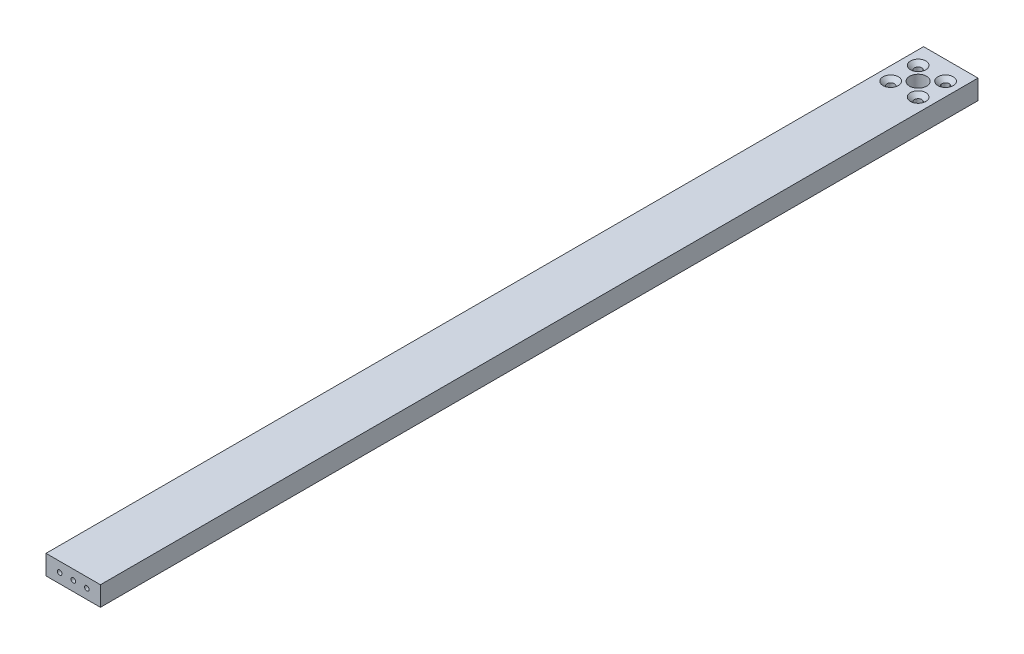
ISO-10303-21;
HEADER;
FILE_DESCRIPTION(('STEP AP214'),'2;1');
FILE_NAME('part.step','',(''),(''),'','','');
FILE_SCHEMA(('AUTOMOTIVE_DESIGN { 1 0 10303 214 1 1 1 1 }'));
ENDSEC;
DATA;
#1=APPLICATION_CONTEXT('core data for automotive mechanical design processes');
#2=APPLICATION_PROTOCOL_DEFINITION('international standard','automotive_design',2000,#1);
#3=PRODUCT_CONTEXT('',#1,'mechanical');
#4=PRODUCT('Part','Part','',(#3));
#5=PRODUCT_RELATED_PRODUCT_CATEGORY('part','',(#4));
#6=PRODUCT_DEFINITION_FORMATION('','',#4);
#7=PRODUCT_DEFINITION_CONTEXT('part definition',#1,'design');
#8=PRODUCT_DEFINITION('design','',#6,#7);
#9=PRODUCT_DEFINITION_SHAPE('','',#8);
#10=(LENGTH_UNIT() NAMED_UNIT(*) SI_UNIT(.MILLI.,.METRE.));
#11=(NAMED_UNIT(*) PLANE_ANGLE_UNIT() SI_UNIT($,.RADIAN.));
#12=(NAMED_UNIT(*) SI_UNIT($,.STERADIAN.) SOLID_ANGLE_UNIT());
#13=UNCERTAINTY_MEASURE_WITH_UNIT(LENGTH_MEASURE(1.E-05),#10,'distance_accuracy_value','');
#14=(GEOMETRIC_REPRESENTATION_CONTEXT(3) GLOBAL_UNCERTAINTY_ASSIGNED_CONTEXT((#13)) GLOBAL_UNIT_ASSIGNED_CONTEXT((#10,
#11,#12)) REPRESENTATION_CONTEXT('',''));
#15=CARTESIAN_POINT('',(0.,0.,0.));
#16=DIRECTION('',(0.,0.,1.));
#17=DIRECTION('',(1.,0.,0.));
#18=AXIS2_PLACEMENT_3D('',#15,#16,#17);
#19=CARTESIAN_POINT('',(0.,28.53,0.));
#20=DIRECTION('',(0.,1.,0.));
#21=DIRECTION('',(0.,0.,1.));
#22=AXIS2_PLACEMENT_3D('',#19,#20,#21);
#23=PLANE('',#22);
#24=CARTESIAN_POINT('',(-8.,28.53,-8.));
#25=DIRECTION('',(0.,1.,0.));
#26=DIRECTION('',(0.,0.,1.));
#27=AXIS2_PLACEMENT_3D('',#24,#25,#26);
#28=CIRCLE('',#27,4.48);
#29=CARTESIAN_POINT('',(-8.,28.53,-3.52));
#30=VERTEX_POINT('',#29);
#31=EDGE_CURVE('E141',#30,#30,#28,.T.);
#32=ORIENTED_EDGE('',*,*,#31,.F.);
#33=EDGE_LOOP('',(#32));
#34=FACE_BOUND('',#33,.T.);
#35=CARTESIAN_POINT('',(8.,28.53,-8.));
#36=DIRECTION('',(0.,1.,0.));
#37=DIRECTION('',(0.,0.,1.));
#38=AXIS2_PLACEMENT_3D('',#35,#36,#37);
#39=CIRCLE('',#38,4.48);
#40=CARTESIAN_POINT('',(8.,28.53,-3.52));
#41=VERTEX_POINT('',#40);
#42=EDGE_CURVE('E150',#41,#41,#39,.T.);
#43=ORIENTED_EDGE('',*,*,#42,.F.);
#44=EDGE_LOOP('',(#43));
#45=FACE_BOUND('',#44,.T.);
#46=CARTESIAN_POINT('',(8.,28.53,8.));
#47=DIRECTION('',(0.,1.,0.));
#48=DIRECTION('',(0.,0.,1.));
#49=AXIS2_PLACEMENT_3D('',#46,#47,#48);
#50=CIRCLE('',#49,4.48);
#51=CARTESIAN_POINT('',(8.,28.53,12.48));
#52=VERTEX_POINT('',#51);
#53=EDGE_CURVE('E159',#52,#52,#50,.T.);
#54=ORIENTED_EDGE('',*,*,#53,.F.);
#55=EDGE_LOOP('',(#54));
#56=FACE_BOUND('',#55,.T.);
#57=CARTESIAN_POINT('',(-8.,28.53,8.));
#58=DIRECTION('',(0.,1.,0.));
#59=DIRECTION('',(0.,0.,1.));
#60=AXIS2_PLACEMENT_3D('',#57,#58,#59);
#61=CIRCLE('',#60,4.48);
#62=CARTESIAN_POINT('',(-8.,28.53,12.48));
#63=VERTEX_POINT('',#62);
#64=EDGE_CURVE('E168',#63,#63,#61,.T.);
#65=ORIENTED_EDGE('',*,*,#64,.F.);
#66=EDGE_LOOP('',(#65));
#67=FACE_BOUND('',#66,.T.);
#68=DIRECTION('',(0.,0.,1.));
#69=VECTOR('',#68,1.);
#70=CARTESIAN_POINT('',(-15.875,28.53,-19.05));
#71=LINE('',#70,#69);
#72=CARTESIAN_POINT('',(-15.875,28.53,-19.05));
#73=VERTEX_POINT('',#72);
#74=CARTESIAN_POINT('',(-15.8749999999999,28.53,492.9124));
#75=VERTEX_POINT('',#74);
#76=EDGE_CURVE('E184',#73,#75,#71,.T.);
#77=ORIENTED_EDGE('',*,*,#76,.T.);
#78=DIRECTION('',(1.,0.,0.));
#79=VECTOR('',#78,1.);
#80=CARTESIAN_POINT('',(-15.8749999999999,28.53,492.9124));
#81=LINE('',#80,#79);
#82=CARTESIAN_POINT('',(15.8749999999999,28.53,492.9124));
#83=VERTEX_POINT('',#82);
#84=EDGE_CURVE('E104',#75,#83,#81,.T.);
#85=ORIENTED_EDGE('',*,*,#84,.T.);
#86=DIRECTION('',(0.,0.,-1.));
#87=VECTOR('',#86,1.);
#88=CARTESIAN_POINT('',(15.875,28.53,-19.05));
#89=LINE('',#88,#87);
#90=CARTESIAN_POINT('',(15.875,28.53,-19.05));
#91=VERTEX_POINT('',#90);
#92=EDGE_CURVE('E187',#83,#91,#89,.T.);
#93=ORIENTED_EDGE('',*,*,#92,.T.);
#94=DIRECTION('',(-1.,0.,0.));
#95=VECTOR('',#94,1.);
#96=CARTESIAN_POINT('',(-15.875,28.53,-19.05));
#97=LINE('',#96,#95);
#98=EDGE_CURVE('E73',#91,#73,#97,.T.);
#99=ORIENTED_EDGE('',*,*,#98,.T.);
#100=EDGE_LOOP('',(#77,#85,#93,#99));
#101=FACE_BOUND('',#100,.T.);
#102=CARTESIAN_POINT('',(0.,28.53,0.));
#103=DIRECTION('',(0.,1.,0.));
#104=DIRECTION('',(0.,0.,1.));
#105=AXIS2_PLACEMENT_3D('',#102,#103,#104);
#106=CIRCLE('',#105,5.);
#107=CARTESIAN_POINT('',(0.,28.53,5.));
#108=VERTEX_POINT('',#107);
#109=EDGE_CURVE('E178',#108,#108,#106,.T.);
#110=ORIENTED_EDGE('',*,*,#109,.F.);
#111=EDGE_LOOP('',(#110));
#112=FACE_BOUND('',#111,.T.);
#113=ADVANCED_FACE('F56',(#34,#45,#56,#67,#101,#112),#23,.T.);
#114=CARTESIAN_POINT('',(0.,17.1,0.));
#115=DIRECTION('',(0.,1.,0.));
#116=DIRECTION('',(0.,0.,1.));
#117=AXIS2_PLACEMENT_3D('',#114,#115,#116);
#118=PLANE('',#117);
#119=CARTESIAN_POINT('',(-8.,17.1,-8.));
#120=DIRECTION('',(0.,1.,0.));
#121=DIRECTION('',(0.,0.,1.));
#122=AXIS2_PLACEMENT_3D('',#119,#120,#121);
#123=CIRCLE('',#122,2.15);
#124=CARTESIAN_POINT('',(-8.,17.1,-5.85));
#125=VERTEX_POINT('',#124);
#126=EDGE_CURVE('E147',#125,#125,#123,.T.);
#127=ORIENTED_EDGE('',*,*,#126,.T.);
#128=EDGE_LOOP('',(#127));
#129=FACE_BOUND('',#128,.T.);
#130=CARTESIAN_POINT('',(8.,17.1,-8.));
#131=DIRECTION('',(0.,1.,0.));
#132=DIRECTION('',(0.,0.,1.));
#133=AXIS2_PLACEMENT_3D('',#130,#131,#132);
#134=CIRCLE('',#133,2.15);
#135=CARTESIAN_POINT('',(8.,17.1,-5.85));
#136=VERTEX_POINT('',#135);
#137=EDGE_CURVE('E156',#136,#136,#134,.T.);
#138=ORIENTED_EDGE('',*,*,#137,.T.);
#139=EDGE_LOOP('',(#138));
#140=FACE_BOUND('',#139,.T.);
#141=CARTESIAN_POINT('',(8.,17.1,8.));
#142=DIRECTION('',(0.,1.,0.));
#143=DIRECTION('',(0.,0.,1.));
#144=AXIS2_PLACEMENT_3D('',#141,#142,#143);
#145=CIRCLE('',#144,2.15);
#146=CARTESIAN_POINT('',(8.,17.1,10.15));
#147=VERTEX_POINT('',#146);
#148=EDGE_CURVE('E165',#147,#147,#145,.T.);
#149=ORIENTED_EDGE('',*,*,#148,.T.);
#150=EDGE_LOOP('',(#149));
#151=FACE_BOUND('',#150,.T.);
#152=CARTESIAN_POINT('',(-8.,17.1,8.));
#153=DIRECTION('',(0.,1.,0.));
#154=DIRECTION('',(0.,0.,1.));
#155=AXIS2_PLACEMENT_3D('',#152,#153,#154);
#156=CIRCLE('',#155,2.15);
#157=CARTESIAN_POINT('',(-8.,17.1,10.15));
#158=VERTEX_POINT('',#157);
#159=EDGE_CURVE('E174',#158,#158,#156,.T.);
#160=ORIENTED_EDGE('',*,*,#159,.T.);
#161=EDGE_LOOP('',(#160));
#162=FACE_BOUND('',#161,.T.);
#163=DIRECTION('',(0.,0.,1.));
#164=VECTOR('',#163,1.);
#165=CARTESIAN_POINT('',(-15.875,17.1,-19.05));
#166=LINE('',#165,#164);
#167=CARTESIAN_POINT('',(-15.875,17.1,-19.05));
#168=VERTEX_POINT('',#167);
#169=CARTESIAN_POINT('',(-15.8749999999999,17.1,492.9124));
#170=VERTEX_POINT('',#169);
#171=EDGE_CURVE('E181',#168,#170,#166,.T.);
#172=ORIENTED_EDGE('',*,*,#171,.F.);
#173=DIRECTION('',(-1.,0.,0.));
#174=VECTOR('',#173,1.);
#175=CARTESIAN_POINT('',(-15.875,17.1,-19.05));
#176=LINE('',#175,#174);
#177=CARTESIAN_POINT('',(15.875,17.1,-19.05));
#178=VERTEX_POINT('',#177);
#179=EDGE_CURVE('E97',#178,#168,#176,.T.);
#180=ORIENTED_EDGE('',*,*,#179,.F.);
#181=DIRECTION('',(0.,0.,-1.));
#182=VECTOR('',#181,1.);
#183=CARTESIAN_POINT('',(15.875,17.1,-19.05));
#184=LINE('',#183,#182);
#185=CARTESIAN_POINT('',(15.8749999999999,17.1,492.9124));
#186=VERTEX_POINT('',#185);
#187=EDGE_CURVE('E91',#186,#178,#184,.T.);
#188=ORIENTED_EDGE('',*,*,#187,.F.);
#189=DIRECTION('',(1.,0.,0.));
#190=VECTOR('',#189,1.);
#191=CARTESIAN_POINT('',(-15.8749999999999,17.1,492.9124));
#192=LINE('',#191,#190);
#193=EDGE_CURVE('E193',#170,#186,#192,.T.);
#194=ORIENTED_EDGE('',*,*,#193,.F.);
#195=EDGE_LOOP('',(#172,#180,#188,#194));
#196=FACE_BOUND('',#195,.T.);
#197=CARTESIAN_POINT('',(0.,17.1,0.));
#198=DIRECTION('',(0.,1.,0.));
#199=DIRECTION('',(0.,0.,1.));
#200=AXIS2_PLACEMENT_3D('',#197,#198,#199);
#201=CIRCLE('',#200,5.);
#202=CARTESIAN_POINT('',(0.,17.1,5.));
#203=VERTEX_POINT('',#202);
#204=EDGE_CURVE('E177',#203,#203,#201,.T.);
#205=ORIENTED_EDGE('',*,*,#204,.T.);
#206=EDGE_LOOP('',(#205));
#207=FACE_BOUND('',#206,.T.);
#208=ADVANCED_FACE('F203',(#129,#140,#151,#162,#196,#207),#118,.F.);
#209=CARTESIAN_POINT('',(-15.875,28.53,-19.05));
#210=DIRECTION('',(1.,0.,0.));
#211=DIRECTION('',(0.,0.,-1.));
#212=AXIS2_PLACEMENT_3D('',#209,#210,#211);
#213=PLANE('',#212);
#214=ORIENTED_EDGE('',*,*,#171,.T.);
#215=DIRECTION('',(0.,-1.,0.));
#216=VECTOR('',#215,1.);
#217=CARTESIAN_POINT('',(-15.8749999999999,28.53,492.9124));
#218=LINE('',#217,#216);
#219=EDGE_CURVE('E11',#75,#170,#218,.T.);
#220=ORIENTED_EDGE('',*,*,#219,.F.);
#221=ORIENTED_EDGE('',*,*,#76,.F.);
#222=DIRECTION('',(0.,-1.,0.));
#223=VECTOR('',#222,1.);
#224=CARTESIAN_POINT('',(-15.875,28.53,-19.05));
#225=LINE('',#224,#223);
#226=EDGE_CURVE('E190',#73,#168,#225,.T.);
#227=ORIENTED_EDGE('',*,*,#226,.T.);
#228=EDGE_LOOP('',(#214,#220,#221,#227));
#229=FACE_BOUND('',#228,.T.);
#230=ADVANCED_FACE('F58',(#229),#213,.F.);
#231=CARTESIAN_POINT('',(-15.8749999999999,28.53,492.9124));
#232=DIRECTION('',(0.,0.,-1.));
#233=DIRECTION('',(-1.,0.,0.));
#234=AXIS2_PLACEMENT_3D('',#231,#232,#233);
#235=PLANE('',#234);
#236=CARTESIAN_POINT('',(-7.93749999999997,22.815,492.9124));
#237=DIRECTION('',(0.,0.,1.));
#238=DIRECTION('',(1.,0.,0.));
#239=AXIS2_PLACEMENT_3D('',#236,#237,#238);
#240=CIRCLE('',#239,1.35254999999999);
#241=CARTESIAN_POINT('',(-6.58494999999998,22.815,492.9124));
#242=VERTEX_POINT('',#241);
#243=EDGE_CURVE('E125',#242,#242,#240,.T.);
#244=ORIENTED_EDGE('',*,*,#243,.F.);
#245=EDGE_LOOP('',(#244));
#246=FACE_BOUND('',#245,.T.);
#247=CARTESIAN_POINT('',(0.,22.815,492.9124));
#248=DIRECTION('',(0.,0.,1.));
#249=DIRECTION('',(1.,0.,0.));
#250=AXIS2_PLACEMENT_3D('',#247,#248,#249);
#251=CIRCLE('',#250,1.35254999999999);
#252=CARTESIAN_POINT('',(1.35254999999999,22.815,492.9124));
#253=VERTEX_POINT('',#252);
#254=EDGE_CURVE('E124',#253,#253,#251,.T.);
#255=ORIENTED_EDGE('',*,*,#254,.F.);
#256=EDGE_LOOP('',(#255));
#257=FACE_BOUND('',#256,.T.);
#258=CARTESIAN_POINT('',(7.93749999999997,22.815,492.9124));
#259=DIRECTION('',(0.,0.,1.));
#260=DIRECTION('',(1.,0.,0.));
#261=AXIS2_PLACEMENT_3D('',#258,#259,#260);
#262=CIRCLE('',#261,1.35254999999999);
#263=CARTESIAN_POINT('',(9.29004999999996,22.815,492.9124));
#264=VERTEX_POINT('',#263);
#265=EDGE_CURVE('E135',#264,#264,#262,.T.);
#266=ORIENTED_EDGE('',*,*,#265,.F.);
#267=EDGE_LOOP('',(#266));
#268=FACE_BOUND('',#267,.T.);
#269=ORIENTED_EDGE('',*,*,#193,.T.);
#270=DIRECTION('',(0.,-1.,0.));
#271=VECTOR('',#270,1.);
#272=CARTESIAN_POINT('',(15.8749999999999,28.53,492.9124));
#273=LINE('',#272,#271);
#274=EDGE_CURVE('E65',#83,#186,#273,.T.);
#275=ORIENTED_EDGE('',*,*,#274,.F.);
#276=ORIENTED_EDGE('',*,*,#84,.F.);
#277=ORIENTED_EDGE('',*,*,#219,.T.);
#278=EDGE_LOOP('',(#269,#275,#276,#277));
#279=FACE_BOUND('',#278,.T.);
#280=ADVANCED_FACE('F219',(#246,#257,#268,#279),#235,.F.);
#281=CARTESIAN_POINT('',(15.875,28.53,-19.05));
#282=DIRECTION('',(-1.,0.,0.));
#283=DIRECTION('',(0.,0.,1.));
#284=AXIS2_PLACEMENT_3D('',#281,#282,#283);
#285=PLANE('',#284);
#286=ORIENTED_EDGE('',*,*,#187,.T.);
#287=DIRECTION('',(0.,-1.,0.));
#288=VECTOR('',#287,1.);
#289=CARTESIAN_POINT('',(15.875,28.53,-19.05));
#290=LINE('',#289,#288);
#291=EDGE_CURVE('E198',#91,#178,#290,.T.);
#292=ORIENTED_EDGE('',*,*,#291,.F.);
#293=ORIENTED_EDGE('',*,*,#92,.F.);
#294=ORIENTED_EDGE('',*,*,#274,.T.);
#295=EDGE_LOOP('',(#286,#292,#293,#294));
#296=FACE_BOUND('',#295,.T.);
#297=ADVANCED_FACE('F200',(#296),#285,.F.);
#298=CARTESIAN_POINT('',(-15.875,28.53,-19.05));
#299=DIRECTION('',(0.,0.,1.));
#300=DIRECTION('',(1.,0.,0.));
#301=AXIS2_PLACEMENT_3D('',#298,#299,#300);
#302=PLANE('',#301);
#303=ORIENTED_EDGE('',*,*,#179,.T.);
#304=ORIENTED_EDGE('',*,*,#226,.F.);
#305=ORIENTED_EDGE('',*,*,#98,.F.);
#306=ORIENTED_EDGE('',*,*,#291,.T.);
#307=EDGE_LOOP('',(#303,#304,#305,#306));
#308=FACE_BOUND('',#307,.T.);
#309=ADVANCED_FACE('F208',(#308),#302,.F.);
#310=CARTESIAN_POINT('',(0.,28.53,0.));
#311=DIRECTION('',(0.,-1.,0.));
#312=DIRECTION('',(0.,0.,-1.));
#313=AXIS2_PLACEMENT_3D('',#310,#311,#312);
#314=CYLINDRICAL_SURFACE('',#313,5.);
#315=ORIENTED_EDGE('',*,*,#109,.T.);
#316=EDGE_LOOP('',(#315));
#317=FACE_BOUND('',#316,.T.);
#318=ORIENTED_EDGE('',*,*,#204,.F.);
#319=EDGE_LOOP('',(#318));
#320=FACE_BOUND('',#319,.T.);
#321=ADVANCED_FACE('F210',(#317,#320),#314,.F.);
#322=CARTESIAN_POINT('',(-8.,28.53,8.));
#323=DIRECTION('',(0.,1.,0.));
#324=DIRECTION('',(0.,0.,1.));
#325=AXIS2_PLACEMENT_3D('',#322,#323,#324);
#326=CYLINDRICAL_SURFACE('',#325,2.15);
#327=ORIENTED_EDGE('',*,*,#159,.F.);
#328=EDGE_LOOP('',(#327));
#329=FACE_BOUND('',#328,.T.);
#330=CARTESIAN_POINT('',(-8.,26.2,8.));
#331=DIRECTION('',(0.,1.,0.));
#332=DIRECTION('',(0.,0.,1.));
#333=AXIS2_PLACEMENT_3D('',#330,#331,#332);
#334=CIRCLE('',#333,2.15);
#335=CARTESIAN_POINT('',(-8.,26.2,10.15));
#336=VERTEX_POINT('',#335);
#337=EDGE_CURVE('E171',#336,#336,#334,.T.);
#338=ORIENTED_EDGE('',*,*,#337,.T.);
#339=EDGE_LOOP('',(#338));
#340=FACE_BOUND('',#339,.T.);
#341=ADVANCED_FACE('F216',(#329,#340),#326,.F.);
#342=CARTESIAN_POINT('',(-8.,28.53,8.));
#343=DIRECTION('',(0.,1.,0.));
#344=DIRECTION('',(0.,0.,1.));
#345=AXIS2_PLACEMENT_3D('',#342,#343,#344);
#346=CONICAL_SURFACE('',#345,4.48,0.785398163397448);
#347=ORIENTED_EDGE('',*,*,#337,.F.);
#348=EDGE_LOOP('',(#347));
#349=FACE_BOUND('',#348,.T.);
#350=ORIENTED_EDGE('',*,*,#64,.T.);
#351=EDGE_LOOP('',(#350));
#352=FACE_BOUND('',#351,.T.);
#353=ADVANCED_FACE('F234',(#349,#352),#346,.F.);
#354=CARTESIAN_POINT('',(8.,28.53,8.));
#355=DIRECTION('',(0.,1.,0.));
#356=DIRECTION('',(0.,0.,1.));
#357=AXIS2_PLACEMENT_3D('',#354,#355,#356);
#358=CYLINDRICAL_SURFACE('',#357,2.15);
#359=ORIENTED_EDGE('',*,*,#148,.F.);
#360=EDGE_LOOP('',(#359));
#361=FACE_BOUND('',#360,.T.);
#362=CARTESIAN_POINT('',(8.,26.2,8.));
#363=DIRECTION('',(0.,1.,0.));
#364=DIRECTION('',(0.,0.,1.));
#365=AXIS2_PLACEMENT_3D('',#362,#363,#364);
#366=CIRCLE('',#365,2.15);
#367=CARTESIAN_POINT('',(8.,26.2,10.15));
#368=VERTEX_POINT('',#367);
#369=EDGE_CURVE('E162',#368,#368,#366,.T.);
#370=ORIENTED_EDGE('',*,*,#369,.T.);
#371=EDGE_LOOP('',(#370));
#372=FACE_BOUND('',#371,.T.);
#373=ADVANCED_FACE('F238',(#361,#372),#358,.F.);
#374=CARTESIAN_POINT('',(8.,28.53,8.));
#375=DIRECTION('',(0.,1.,0.));
#376=DIRECTION('',(0.,0.,1.));
#377=AXIS2_PLACEMENT_3D('',#374,#375,#376);
#378=CONICAL_SURFACE('',#377,4.48,0.785398163397448);
#379=ORIENTED_EDGE('',*,*,#369,.F.);
#380=EDGE_LOOP('',(#379));
#381=FACE_BOUND('',#380,.T.);
#382=ORIENTED_EDGE('',*,*,#53,.T.);
#383=EDGE_LOOP('',(#382));
#384=FACE_BOUND('',#383,.T.);
#385=ADVANCED_FACE('F242',(#381,#384),#378,.F.);
#386=CARTESIAN_POINT('',(8.,28.53,-8.));
#387=DIRECTION('',(0.,1.,0.));
#388=DIRECTION('',(0.,0.,1.));
#389=AXIS2_PLACEMENT_3D('',#386,#387,#388);
#390=CYLINDRICAL_SURFACE('',#389,2.15);
#391=ORIENTED_EDGE('',*,*,#137,.F.);
#392=EDGE_LOOP('',(#391));
#393=FACE_BOUND('',#392,.T.);
#394=CARTESIAN_POINT('',(8.,26.2,-8.));
#395=DIRECTION('',(0.,1.,0.));
#396=DIRECTION('',(0.,0.,1.));
#397=AXIS2_PLACEMENT_3D('',#394,#395,#396);
#398=CIRCLE('',#397,2.15);
#399=CARTESIAN_POINT('',(8.,26.2,-5.85));
#400=VERTEX_POINT('',#399);
#401=EDGE_CURVE('E153',#400,#400,#398,.T.);
#402=ORIENTED_EDGE('',*,*,#401,.T.);
#403=EDGE_LOOP('',(#402));
#404=FACE_BOUND('',#403,.T.);
#405=ADVANCED_FACE('F246',(#393,#404),#390,.F.);
#406=CARTESIAN_POINT('',(8.,28.53,-8.));
#407=DIRECTION('',(0.,1.,0.));
#408=DIRECTION('',(0.,0.,1.));
#409=AXIS2_PLACEMENT_3D('',#406,#407,#408);
#410=CONICAL_SURFACE('',#409,4.48,0.785398163397448);
#411=ORIENTED_EDGE('',*,*,#401,.F.);
#412=EDGE_LOOP('',(#411));
#413=FACE_BOUND('',#412,.T.);
#414=ORIENTED_EDGE('',*,*,#42,.T.);
#415=EDGE_LOOP('',(#414));
#416=FACE_BOUND('',#415,.T.);
#417=ADVANCED_FACE('F250',(#413,#416),#410,.F.);
#418=CARTESIAN_POINT('',(-8.,28.53,-8.));
#419=DIRECTION('',(0.,1.,0.));
#420=DIRECTION('',(0.,0.,1.));
#421=AXIS2_PLACEMENT_3D('',#418,#419,#420);
#422=CYLINDRICAL_SURFACE('',#421,2.15);
#423=ORIENTED_EDGE('',*,*,#126,.F.);
#424=EDGE_LOOP('',(#423));
#425=FACE_BOUND('',#424,.T.);
#426=CARTESIAN_POINT('',(-8.,26.2,-8.));
#427=DIRECTION('',(0.,1.,0.));
#428=DIRECTION('',(0.,0.,1.));
#429=AXIS2_PLACEMENT_3D('',#426,#427,#428);
#430=CIRCLE('',#429,2.15);
#431=CARTESIAN_POINT('',(-8.,26.2,-5.85));
#432=VERTEX_POINT('',#431);
#433=EDGE_CURVE('E144',#432,#432,#430,.T.);
#434=ORIENTED_EDGE('',*,*,#433,.T.);
#435=EDGE_LOOP('',(#434));
#436=FACE_BOUND('',#435,.T.);
#437=ADVANCED_FACE('F254',(#425,#436),#422,.F.);
#438=CARTESIAN_POINT('',(-8.,28.53,-8.));
#439=DIRECTION('',(0.,1.,0.));
#440=DIRECTION('',(0.,0.,1.));
#441=AXIS2_PLACEMENT_3D('',#438,#439,#440);
#442=CONICAL_SURFACE('',#441,4.48,0.785398163397448);
#443=ORIENTED_EDGE('',*,*,#433,.F.);
#444=EDGE_LOOP('',(#443));
#445=FACE_BOUND('',#444,.T.);
#446=ORIENTED_EDGE('',*,*,#31,.T.);
#447=EDGE_LOOP('',(#446));
#448=FACE_BOUND('',#447,.T.);
#449=ADVANCED_FACE('F258',(#445,#448),#442,.F.);
#450=CARTESIAN_POINT('',(7.93749999999997,22.815,479.425));
#451=DIRECTION('',(0.,0.,1.));
#452=DIRECTION('',(1.,0.,0.));
#453=AXIS2_PLACEMENT_3D('',#450,#451,#452);
#454=CONICAL_SURFACE('',#453,1.35254999999999,1.02974425867664);
#455=CARTESIAN_POINT('',(7.93749999999997,22.815,478.612305969734));
#456=VERTEX_POINT('',#455);
#457=VERTEX_LOOP('',#456);
#458=FACE_BOUND('',#457,.T.);
#459=CARTESIAN_POINT('',(7.93749999999997,22.815,479.425));
#460=DIRECTION('',(0.,0.,1.));
#461=DIRECTION('',(1.,0.,0.));
#462=AXIS2_PLACEMENT_3D('',#459,#460,#461);
#463=CIRCLE('',#462,1.35254999999999);
#464=CARTESIAN_POINT('',(9.29004999999996,22.815,479.425));
#465=VERTEX_POINT('',#464);
#466=EDGE_CURVE('E138',#465,#465,#463,.T.);
#467=ORIENTED_EDGE('',*,*,#466,.T.);
#468=EDGE_LOOP('',(#467));
#469=FACE_BOUND('',#468,.T.);
#470=ADVANCED_FACE('F262',(#458,#469),#454,.F.);
#471=CARTESIAN_POINT('',(7.93749999999997,22.815,492.9124));
#472=DIRECTION('',(0.,0.,1.));
#473=DIRECTION('',(1.,0.,0.));
#474=AXIS2_PLACEMENT_3D('',#471,#472,#473);
#475=CYLINDRICAL_SURFACE('',#474,1.35254999999999);
#476=ORIENTED_EDGE('',*,*,#466,.F.);
#477=EDGE_LOOP('',(#476));
#478=FACE_BOUND('',#477,.T.);
#479=ORIENTED_EDGE('',*,*,#265,.T.);
#480=EDGE_LOOP('',(#479));
#481=FACE_BOUND('',#480,.T.);
#482=ADVANCED_FACE('F266',(#478,#481),#475,.F.);
#483=CARTESIAN_POINT('',(0.,22.815,479.425));
#484=DIRECTION('',(0.,0.,1.));
#485=DIRECTION('',(1.,0.,0.));
#486=AXIS2_PLACEMENT_3D('',#483,#484,#485);
#487=CONICAL_SURFACE('',#486,1.35254999999999,1.02974425867664);
#488=CARTESIAN_POINT('',(0.,22.815,478.612305969734));
#489=VERTEX_POINT('',#488);
#490=VERTEX_LOOP('',#489);
#491=FACE_BOUND('',#490,.T.);
#492=CARTESIAN_POINT('',(0.,22.815,479.425));
#493=DIRECTION('',(0.,0.,1.));
#494=DIRECTION('',(1.,0.,0.));
#495=AXIS2_PLACEMENT_3D('',#492,#493,#494);
#496=CIRCLE('',#495,1.35254999999999);
#497=CARTESIAN_POINT('',(1.35254999999999,22.815,479.425));
#498=VERTEX_POINT('',#497);
#499=EDGE_CURVE('E128',#498,#498,#496,.T.);
#500=ORIENTED_EDGE('',*,*,#499,.T.);
#501=EDGE_LOOP('',(#500));
#502=FACE_BOUND('',#501,.T.);
#503=ADVANCED_FACE('F270',(#491,#502),#487,.F.);
#504=CARTESIAN_POINT('',(0.,22.815,492.9124));
#505=DIRECTION('',(0.,0.,1.));
#506=DIRECTION('',(1.,0.,0.));
#507=AXIS2_PLACEMENT_3D('',#504,#505,#506);
#508=CYLINDRICAL_SURFACE('',#507,1.35254999999999);
#509=ORIENTED_EDGE('',*,*,#499,.F.);
#510=EDGE_LOOP('',(#509));
#511=FACE_BOUND('',#510,.T.);
#512=ORIENTED_EDGE('',*,*,#254,.T.);
#513=EDGE_LOOP('',(#512));
#514=FACE_BOUND('',#513,.T.);
#515=ADVANCED_FACE('F118',(#511,#514),#508,.F.);
#516=CARTESIAN_POINT('',(-7.93749999999997,22.815,479.425));
#517=DIRECTION('',(0.,0.,1.));
#518=DIRECTION('',(1.,0.,0.));
#519=AXIS2_PLACEMENT_3D('',#516,#517,#518);
#520=CONICAL_SURFACE('',#519,1.35254999999999,1.02974425867664);
#521=CARTESIAN_POINT('',(-7.93749999999997,22.815,478.612305969734));
#522=VERTEX_POINT('',#521);
#523=VERTEX_LOOP('',#522);
#524=FACE_BOUND('',#523,.T.);
#525=CARTESIAN_POINT('',(-7.93749999999997,22.815,479.425));
#526=DIRECTION('',(0.,0.,1.));
#527=DIRECTION('',(1.,0.,0.));
#528=AXIS2_PLACEMENT_3D('',#525,#526,#527);
#529=CIRCLE('',#528,1.35254999999999);
#530=CARTESIAN_POINT('',(-6.58494999999998,22.815,479.425));
#531=VERTEX_POINT('',#530);
#532=EDGE_CURVE('E122',#531,#531,#529,.T.);
#533=ORIENTED_EDGE('',*,*,#532,.T.);
#534=EDGE_LOOP('',(#533));
#535=FACE_BOUND('',#534,.T.);
#536=ADVANCED_FACE('F114',(#524,#535),#520,.F.);
#537=CARTESIAN_POINT('',(-7.93749999999997,22.815,492.9124));
#538=DIRECTION('',(0.,0.,1.));
#539=DIRECTION('',(1.,0.,0.));
#540=AXIS2_PLACEMENT_3D('',#537,#538,#539);
#541=CYLINDRICAL_SURFACE('',#540,1.35254999999999);
#542=ORIENTED_EDGE('',*,*,#532,.F.);
#543=EDGE_LOOP('',(#542));
#544=FACE_BOUND('',#543,.T.);
#545=ORIENTED_EDGE('',*,*,#243,.T.);
#546=EDGE_LOOP('',(#545));
#547=FACE_BOUND('',#546,.T.);
#548=ADVANCED_FACE('F117',(#544,#547),#541,.F.);
#549=CLOSED_SHELL('',(#113,#208,#230,#280,#297,#309,#321,#341,#353,#373,#385,#405,#417,#437,
#449,#470,#482,#503,#515,#536,#548));
#550=MANIFOLD_SOLID_BREP('B2',#549);
#551=ADVANCED_BREP_SHAPE_REPRESENTATION('',(#18,#550),#14);
#552=SHAPE_DEFINITION_REPRESENTATION(#9,#551);
ENDSEC;
END-ISO-10303-21;
